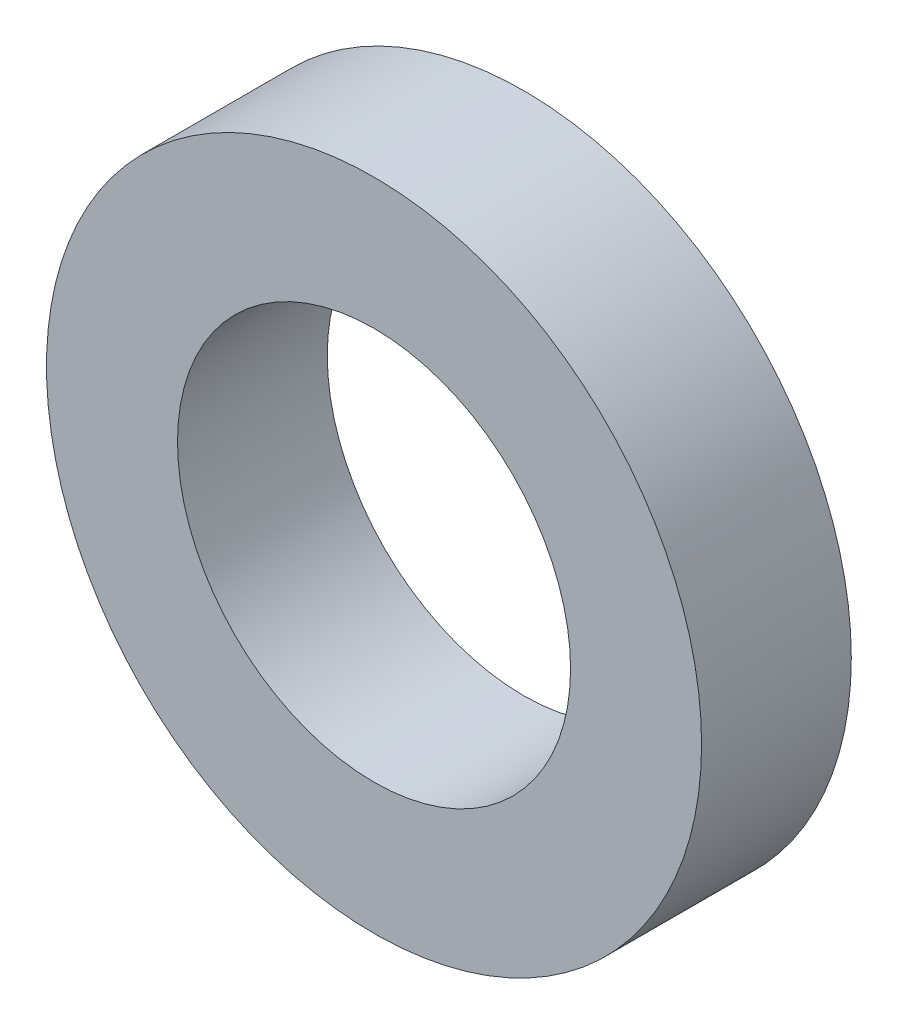
ISO-10303-21;
HEADER;
FILE_DESCRIPTION(('STEP AP214'),'2;1');
FILE_NAME('part.step','',(''),(''),'','','');
FILE_SCHEMA(('AUTOMOTIVE_DESIGN { 1 0 10303 214 1 1 1 1 }'));
ENDSEC;
DATA;
#1=APPLICATION_CONTEXT('core data for automotive mechanical design processes');
#2=APPLICATION_PROTOCOL_DEFINITION('international standard','automotive_design',2000,#1);
#3=PRODUCT_CONTEXT('',#1,'mechanical');
#4=PRODUCT('Part','Part','',(#3));
#5=PRODUCT_RELATED_PRODUCT_CATEGORY('part','',(#4));
#6=PRODUCT_DEFINITION_FORMATION('','',#4);
#7=PRODUCT_DEFINITION_CONTEXT('part definition',#1,'design');
#8=PRODUCT_DEFINITION('design','',#6,#7);
#9=PRODUCT_DEFINITION_SHAPE('','',#8);
#10=(LENGTH_UNIT() NAMED_UNIT(*) SI_UNIT(.MILLI.,.METRE.));
#11=(NAMED_UNIT(*) PLANE_ANGLE_UNIT() SI_UNIT($,.RADIAN.));
#12=(NAMED_UNIT(*) SI_UNIT($,.STERADIAN.) SOLID_ANGLE_UNIT());
#13=UNCERTAINTY_MEASURE_WITH_UNIT(LENGTH_MEASURE(1.E-05),#10,'distance_accuracy_value','');
#14=(GEOMETRIC_REPRESENTATION_CONTEXT(3) GLOBAL_UNCERTAINTY_ASSIGNED_CONTEXT((#13)) GLOBAL_UNIT_ASSIGNED_CONTEXT((#10,
#11,#12)) REPRESENTATION_CONTEXT('',''));
#15=CARTESIAN_POINT('',(0.,0.,0.));
#16=DIRECTION('',(0.,0.,1.));
#17=DIRECTION('',(1.,0.,0.));
#18=AXIS2_PLACEMENT_3D('',#15,#16,#17);
#19=CARTESIAN_POINT('',(0.,0.,0.4));
#20=DIRECTION('',(0.,0.,1.));
#21=DIRECTION('',(1.,0.,0.));
#22=AXIS2_PLACEMENT_3D('',#19,#20,#21);
#23=PLANE('',#22);
#24=CARTESIAN_POINT('',(0.,0.,0.4));
#25=DIRECTION('',(0.,0.,1.));
#26=DIRECTION('',(1.,0.,0.));
#27=AXIS2_PLACEMENT_3D('',#24,#25,#26);
#28=CIRCLE('',#27,1.75);
#29=CARTESIAN_POINT('',(1.75,0.,0.4));
#30=VERTEX_POINT('',#29);
#31=EDGE_CURVE('E10',#30,#30,#28,.T.);
#32=ORIENTED_EDGE('',*,*,#31,.T.);
#33=EDGE_LOOP('',(#32));
#34=FACE_BOUND('',#33,.T.);
#35=CARTESIAN_POINT('',(0.,0.,0.4));
#36=DIRECTION('',(0.,0.,1.));
#37=DIRECTION('',(1.,0.,0.));
#38=AXIS2_PLACEMENT_3D('',#35,#36,#37);
#39=CIRCLE('',#38,1.05);
#40=CARTESIAN_POINT('',(1.05,0.,0.4));
#41=VERTEX_POINT('',#40);
#42=EDGE_CURVE('E42',#41,#41,#39,.T.);
#43=ORIENTED_EDGE('',*,*,#42,.F.);
#44=EDGE_LOOP('',(#43));
#45=FACE_BOUND('',#44,.T.);
#46=ADVANCED_FACE('F31',(#34,#45),#23,.T.);
#47=CARTESIAN_POINT('',(0.,0.,-0.4));
#48=DIRECTION('',(0.,0.,1.));
#49=DIRECTION('',(1.,0.,0.));
#50=AXIS2_PLACEMENT_3D('',#47,#48,#49);
#51=PLANE('',#50);
#52=CARTESIAN_POINT('',(0.,0.,-0.4));
#53=DIRECTION('',(0.,0.,1.));
#54=DIRECTION('',(1.,0.,0.));
#55=AXIS2_PLACEMENT_3D('',#52,#53,#54);
#56=CIRCLE('',#55,1.75);
#57=CARTESIAN_POINT('',(1.75,0.,-0.4));
#58=VERTEX_POINT('',#57);
#59=EDGE_CURVE('E35',#58,#58,#56,.T.);
#60=ORIENTED_EDGE('',*,*,#59,.F.);
#61=EDGE_LOOP('',(#60));
#62=FACE_BOUND('',#61,.T.);
#63=CARTESIAN_POINT('',(0.,0.,-0.4));
#64=DIRECTION('',(0.,0.,1.));
#65=DIRECTION('',(1.,0.,0.));
#66=AXIS2_PLACEMENT_3D('',#63,#64,#65);
#67=CIRCLE('',#66,1.05);
#68=CARTESIAN_POINT('',(1.05,0.,-0.4));
#69=VERTEX_POINT('',#68);
#70=EDGE_CURVE('E44',#69,#69,#67,.T.);
#71=ORIENTED_EDGE('',*,*,#70,.T.);
#72=EDGE_LOOP('',(#71));
#73=FACE_BOUND('',#72,.T.);
#74=ADVANCED_FACE('F54',(#62,#73),#51,.F.);
#75=CARTESIAN_POINT('',(0.,0.,0.4));
#76=DIRECTION('',(0.,0.,-1.));
#77=DIRECTION('',(-1.,0.,0.));
#78=AXIS2_PLACEMENT_3D('',#75,#76,#77);
#79=CYLINDRICAL_SURFACE('',#78,1.75);
#80=ORIENTED_EDGE('',*,*,#31,.F.);
#81=EDGE_LOOP('',(#80));
#82=FACE_BOUND('',#81,.T.);
#83=ORIENTED_EDGE('',*,*,#59,.T.);
#84=EDGE_LOOP('',(#83));
#85=FACE_BOUND('',#84,.T.);
#86=ADVANCED_FACE('F33',(#82,#85),#79,.T.);
#87=CARTESIAN_POINT('',(0.,0.,0.4));
#88=DIRECTION('',(0.,0.,-1.));
#89=DIRECTION('',(-1.,0.,0.));
#90=AXIS2_PLACEMENT_3D('',#87,#88,#89);
#91=CYLINDRICAL_SURFACE('',#90,1.05);
#92=ORIENTED_EDGE('',*,*,#42,.T.);
#93=EDGE_LOOP('',(#92));
#94=FACE_BOUND('',#93,.T.);
#95=ORIENTED_EDGE('',*,*,#70,.F.);
#96=EDGE_LOOP('',(#95));
#97=FACE_BOUND('',#96,.T.);
#98=ADVANCED_FACE('F50',(#94,#97),#91,.F.);
#99=CLOSED_SHELL('',(#46,#74,#86,#98));
#100=MANIFOLD_SOLID_BREP('B2',#99);
#101=ADVANCED_BREP_SHAPE_REPRESENTATION('',(#18,#100),#14);
#102=SHAPE_DEFINITION_REPRESENTATION(#9,#101);
ENDSEC;
END-ISO-10303-21;
